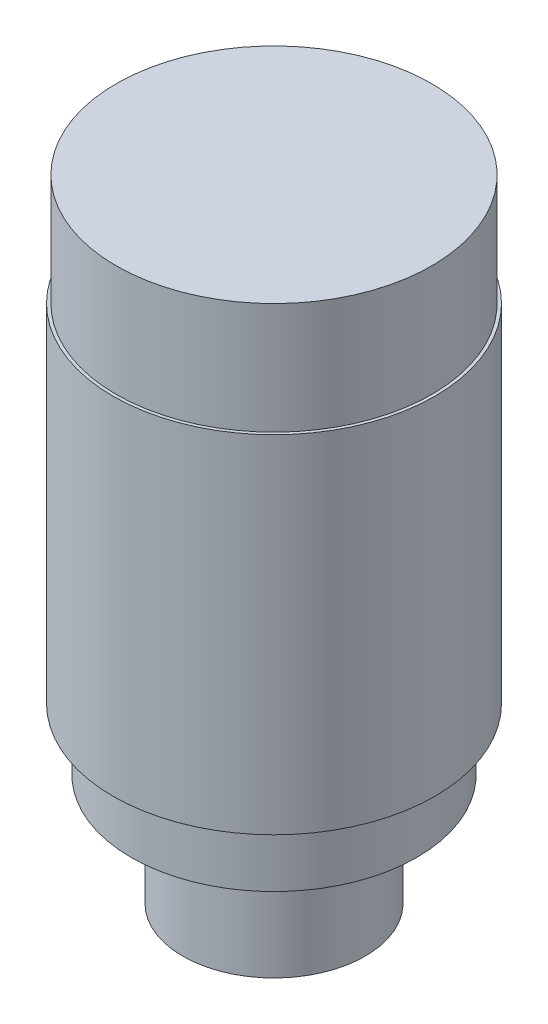
ISO-10303-21;
HEADER;
FILE_DESCRIPTION(('STEP AP214'),'2;1');
FILE_NAME('part.step','',(''),(''),'','','');
FILE_SCHEMA(('AUTOMOTIVE_DESIGN { 1 0 10303 214 1 1 1 1 }'));
ENDSEC;
DATA;
#1=APPLICATION_CONTEXT('core data for automotive mechanical design processes');
#2=APPLICATION_PROTOCOL_DEFINITION('international standard','automotive_design',2000,#1);
#3=PRODUCT_CONTEXT('',#1,'mechanical');
#4=PRODUCT('Part','Part','',(#3));
#5=PRODUCT_RELATED_PRODUCT_CATEGORY('part','',(#4));
#6=PRODUCT_DEFINITION_FORMATION('','',#4);
#7=PRODUCT_DEFINITION_CONTEXT('part definition',#1,'design');
#8=PRODUCT_DEFINITION('design','',#6,#7);
#9=PRODUCT_DEFINITION_SHAPE('','',#8);
#10=(LENGTH_UNIT() NAMED_UNIT(*) SI_UNIT(.MILLI.,.METRE.));
#11=(NAMED_UNIT(*) PLANE_ANGLE_UNIT() SI_UNIT($,.RADIAN.));
#12=(NAMED_UNIT(*) SI_UNIT($,.STERADIAN.) SOLID_ANGLE_UNIT());
#13=UNCERTAINTY_MEASURE_WITH_UNIT(LENGTH_MEASURE(1.E-05),#10,'distance_accuracy_value','');
#14=(GEOMETRIC_REPRESENTATION_CONTEXT(3) GLOBAL_UNCERTAINTY_ASSIGNED_CONTEXT((#13)) GLOBAL_UNIT_ASSIGNED_CONTEXT((#10,
#11,#12)) REPRESENTATION_CONTEXT('',''));
#15=CARTESIAN_POINT('',(0.,0.,0.));
#16=DIRECTION('',(0.,0.,1.));
#17=DIRECTION('',(1.,0.,0.));
#18=AXIS2_PLACEMENT_3D('',#15,#16,#17);
#19=CARTESIAN_POINT('',(0.,102.,0.));
#20=DIRECTION('',(0.,-1.,0.));
#21=DIRECTION('',(0.,0.,-1.));
#22=AXIS2_PLACEMENT_3D('',#19,#20,#21);
#23=CYLINDRICAL_SURFACE('',#22,26.);
#24=CARTESIAN_POINT('',(0.,28.,0.));
#25=DIRECTION('',(0.,1.,0.));
#26=DIRECTION('',(0.,0.,1.));
#27=AXIS2_PLACEMENT_3D('',#24,#25,#26);
#28=CIRCLE('',#27,26.);
#29=CARTESIAN_POINT('',(0.,28.,26.));
#30=VERTEX_POINT('',#29);
#31=EDGE_CURVE('E50',#30,#30,#28,.T.);
#32=ORIENTED_EDGE('',*,*,#31,.T.);
#33=EDGE_LOOP('',(#32));
#34=FACE_BOUND('',#33,.T.);
#35=CARTESIAN_POINT('',(0.,84.,0.));
#36=DIRECTION('',(0.,1.,0.));
#37=DIRECTION('',(0.,0.,1.));
#38=AXIS2_PLACEMENT_3D('',#35,#36,#37);
#39=CIRCLE('',#38,26.);
#40=CARTESIAN_POINT('',(0.,84.,26.));
#41=VERTEX_POINT('',#40);
#42=EDGE_CURVE('E55',#41,#41,#39,.T.);
#43=ORIENTED_EDGE('',*,*,#42,.F.);
#44=EDGE_LOOP('',(#43));
#45=FACE_BOUND('',#44,.T.);
#46=ADVANCED_FACE('F34',(#34,#45),#23,.T.);
#47=CARTESIAN_POINT('',(0.,18.,0.));
#48=DIRECTION('',(0.,-1.,0.));
#49=DIRECTION('',(0.,0.,-1.));
#50=AXIS2_PLACEMENT_3D('',#47,#48,#49);
#51=CYLINDRICAL_SURFACE('',#50,14.75);
#52=CARTESIAN_POINT('',(0.,18.,0.));
#53=DIRECTION('',(0.,1.,0.));
#54=DIRECTION('',(0.,0.,1.));
#55=AXIS2_PLACEMENT_3D('',#52,#53,#54);
#56=CIRCLE('',#55,14.75);
#57=CARTESIAN_POINT('',(0.,18.,14.75));
#58=VERTEX_POINT('',#57);
#59=EDGE_CURVE('E10',#58,#58,#56,.T.);
#60=ORIENTED_EDGE('',*,*,#59,.F.);
#61=EDGE_LOOP('',(#60));
#62=FACE_BOUND('',#61,.T.);
#63=CARTESIAN_POINT('',(0.,0.,0.));
#64=DIRECTION('',(0.,1.,0.));
#65=DIRECTION('',(0.,0.,1.));
#66=AXIS2_PLACEMENT_3D('',#63,#64,#65);
#67=CIRCLE('',#66,14.75);
#68=CARTESIAN_POINT('',(0.,0.,14.75));
#69=VERTEX_POINT('',#68);
#70=EDGE_CURVE('E38',#69,#69,#67,.T.);
#71=ORIENTED_EDGE('',*,*,#70,.T.);
#72=EDGE_LOOP('',(#71));
#73=FACE_BOUND('',#72,.T.);
#74=ADVANCED_FACE('F36',(#62,#73),#51,.T.);
#75=CARTESIAN_POINT('',(0.,0.,0.));
#76=DIRECTION('',(0.,1.,0.));
#77=DIRECTION('',(0.,0.,1.));
#78=AXIS2_PLACEMENT_3D('',#75,#76,#77);
#79=PLANE('',#78);
#80=ORIENTED_EDGE('',*,*,#70,.F.);
#81=EDGE_LOOP('',(#80));
#82=FACE_BOUND('',#81,.T.);
#83=ADVANCED_FACE('F81',(#82),#79,.F.);
#84=CARTESIAN_POINT('',(0.,28.,0.));
#85=DIRECTION('',(0.,-1.,0.));
#86=DIRECTION('',(0.,0.,-1.));
#87=AXIS2_PLACEMENT_3D('',#84,#85,#86);
#88=CYLINDRICAL_SURFACE('',#87,23.1);
#89=CARTESIAN_POINT('',(0.,28.,0.));
#90=DIRECTION('',(0.,1.,0.));
#91=DIRECTION('',(0.,0.,1.));
#92=AXIS2_PLACEMENT_3D('',#89,#90,#91);
#93=CIRCLE('',#92,23.1);
#94=CARTESIAN_POINT('',(0.,28.,23.1));
#95=VERTEX_POINT('',#94);
#96=EDGE_CURVE('E45',#95,#95,#93,.T.);
#97=ORIENTED_EDGE('',*,*,#96,.F.);
#98=EDGE_LOOP('',(#97));
#99=FACE_BOUND('',#98,.T.);
#100=CARTESIAN_POINT('',(0.,18.,0.));
#101=DIRECTION('',(0.,1.,0.));
#102=DIRECTION('',(0.,0.,1.));
#103=AXIS2_PLACEMENT_3D('',#100,#101,#102);
#104=CIRCLE('',#103,23.1);
#105=CARTESIAN_POINT('',(0.,18.,23.1));
#106=VERTEX_POINT('',#105);
#107=EDGE_CURVE('E47',#106,#106,#104,.T.);
#108=ORIENTED_EDGE('',*,*,#107,.T.);
#109=EDGE_LOOP('',(#108));
#110=FACE_BOUND('',#109,.T.);
#111=ADVANCED_FACE('F89',(#99,#110),#88,.T.);
#112=CARTESIAN_POINT('',(0.,18.,0.));
#113=DIRECTION('',(0.,1.,0.));
#114=DIRECTION('',(0.,0.,1.));
#115=AXIS2_PLACEMENT_3D('',#112,#113,#114);
#116=PLANE('',#115);
#117=ORIENTED_EDGE('',*,*,#59,.T.);
#118=EDGE_LOOP('',(#117));
#119=FACE_BOUND('',#118,.T.);
#120=ORIENTED_EDGE('',*,*,#107,.F.);
#121=EDGE_LOOP('',(#120));
#122=FACE_BOUND('',#121,.T.);
#123=ADVANCED_FACE('F86',(#119,#122),#116,.F.);
#124=CARTESIAN_POINT('',(0.,28.,0.));
#125=DIRECTION('',(0.,1.,0.));
#126=DIRECTION('',(0.,0.,1.));
#127=AXIS2_PLACEMENT_3D('',#124,#125,#126);
#128=PLANE('',#127);
#129=ORIENTED_EDGE('',*,*,#96,.T.);
#130=EDGE_LOOP('',(#129));
#131=FACE_BOUND('',#130,.T.);
#132=ORIENTED_EDGE('',*,*,#31,.F.);
#133=EDGE_LOOP('',(#132));
#134=FACE_BOUND('',#133,.T.);
#135=ADVANCED_FACE('F71',(#131,#134),#128,.F.);
#136=CARTESIAN_POINT('',(0.,84.,0.));
#137=DIRECTION('',(0.,1.,0.));
#138=DIRECTION('',(0.,0.,1.));
#139=AXIS2_PLACEMENT_3D('',#136,#137,#138);
#140=PLANE('',#139);
#141=CARTESIAN_POINT('',(0.,84.,0.));
#142=DIRECTION('',(0.,1.,0.));
#143=DIRECTION('',(0.,0.,1.));
#144=AXIS2_PLACEMENT_3D('',#141,#142,#143);
#145=CIRCLE('',#144,25.5);
#146=CARTESIAN_POINT('',(0.,84.,25.5));
#147=VERTEX_POINT('',#146);
#148=EDGE_CURVE('E58',#147,#147,#145,.T.);
#149=ORIENTED_EDGE('',*,*,#148,.F.);
#150=EDGE_LOOP('',(#149));
#151=FACE_BOUND('',#150,.T.);
#152=ORIENTED_EDGE('',*,*,#42,.T.);
#153=EDGE_LOOP('',(#152));
#154=FACE_BOUND('',#153,.T.);
#155=ADVANCED_FACE('F68',(#151,#154),#140,.T.);
#156=CARTESIAN_POINT('',(0.,84.,0.));
#157=DIRECTION('',(0.,1.,0.));
#158=DIRECTION('',(0.,0.,1.));
#159=AXIS2_PLACEMENT_3D('',#156,#157,#158);
#160=CYLINDRICAL_SURFACE('',#159,25.5);
#161=ORIENTED_EDGE('',*,*,#148,.T.);
#162=EDGE_LOOP('',(#161));
#163=FACE_BOUND('',#162,.T.);
#164=CARTESIAN_POINT('',(0.,102.,0.));
#165=DIRECTION('',(0.,1.,0.));
#166=DIRECTION('',(0.,0.,1.));
#167=AXIS2_PLACEMENT_3D('',#164,#165,#166);
#168=CIRCLE('',#167,25.5);
#169=CARTESIAN_POINT('',(0.,102.,25.5));
#170=VERTEX_POINT('',#169);
#171=EDGE_CURVE('E59',#170,#170,#168,.T.);
#172=ORIENTED_EDGE('',*,*,#171,.F.);
#173=EDGE_LOOP('',(#172));
#174=FACE_BOUND('',#173,.T.);
#175=ADVANCED_FACE('F65',(#163,#174),#160,.T.);
#176=CARTESIAN_POINT('',(0.,102.,0.));
#177=DIRECTION('',(0.,1.,0.));
#178=DIRECTION('',(0.,0.,1.));
#179=AXIS2_PLACEMENT_3D('',#176,#177,#178);
#180=PLANE('',#179);
#181=ORIENTED_EDGE('',*,*,#171,.T.);
#182=EDGE_LOOP('',(#181));
#183=FACE_BOUND('',#182,.T.);
#184=ADVANCED_FACE('F125',(#183),#180,.T.);
#185=CLOSED_SHELL('',(#46,#74,#83,#111,#123,#135,#155,#175,#184));
#186=MANIFOLD_SOLID_BREP('B2',#185);
#187=ADVANCED_BREP_SHAPE_REPRESENTATION('',(#18,#186),#14);
#188=SHAPE_DEFINITION_REPRESENTATION(#9,#187);
ENDSEC;
END-ISO-10303-21;
